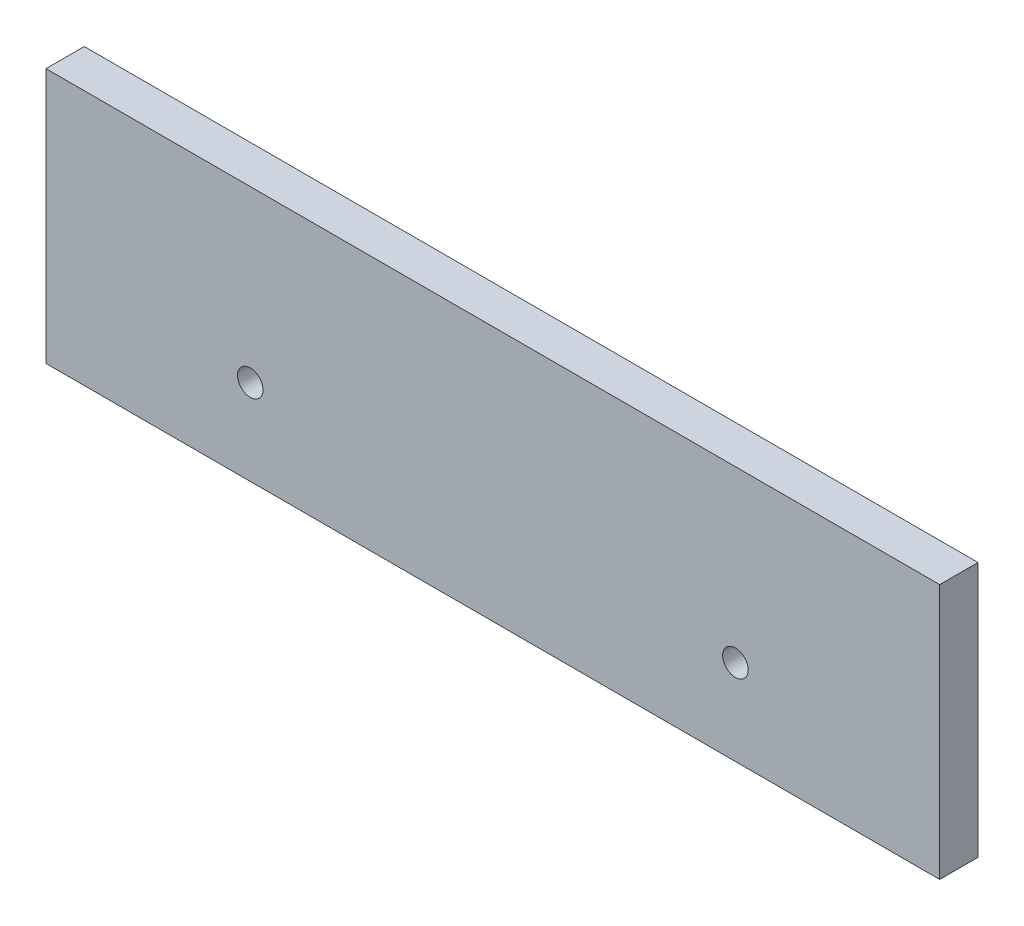
ISO-10303-21;
HEADER;
FILE_DESCRIPTION(('STEP AP214'),'2;1');
FILE_NAME('part.step','',(''),(''),'','','');
FILE_SCHEMA(('AUTOMOTIVE_DESIGN { 1 0 10303 214 1 1 1 1 }'));
ENDSEC;
DATA;
#1=APPLICATION_CONTEXT('core data for automotive mechanical design processes');
#2=APPLICATION_PROTOCOL_DEFINITION('international standard','automotive_design',2000,#1);
#3=PRODUCT_CONTEXT('',#1,'mechanical');
#4=PRODUCT('Part','Part','',(#3));
#5=PRODUCT_RELATED_PRODUCT_CATEGORY('part','',(#4));
#6=PRODUCT_DEFINITION_FORMATION('','',#4);
#7=PRODUCT_DEFINITION_CONTEXT('part definition',#1,'design');
#8=PRODUCT_DEFINITION('design','',#6,#7);
#9=PRODUCT_DEFINITION_SHAPE('','',#8);
#10=(LENGTH_UNIT() NAMED_UNIT(*) SI_UNIT(.MILLI.,.METRE.));
#11=(NAMED_UNIT(*) PLANE_ANGLE_UNIT() SI_UNIT($,.RADIAN.));
#12=(NAMED_UNIT(*) SI_UNIT($,.STERADIAN.) SOLID_ANGLE_UNIT());
#13=UNCERTAINTY_MEASURE_WITH_UNIT(LENGTH_MEASURE(1.E-05),#10,'distance_accuracy_value','');
#14=(GEOMETRIC_REPRESENTATION_CONTEXT(3) GLOBAL_UNCERTAINTY_ASSIGNED_CONTEXT((#13)) GLOBAL_UNIT_ASSIGNED_CONTEXT((#10,
#11,#12)) REPRESENTATION_CONTEXT('',''));
#15=CARTESIAN_POINT('',(0.,0.,0.));
#16=DIRECTION('',(0.,0.,1.));
#17=DIRECTION('',(1.,0.,0.));
#18=AXIS2_PLACEMENT_3D('',#15,#16,#17);
#19=CARTESIAN_POINT('',(-121.149822385747,12.2405260959693,39.3118505720358));
#20=DIRECTION('',(1.,0.,0.));
#21=DIRECTION('',(0.,0.,-1.));
#22=AXIS2_PLACEMENT_3D('',#19,#20,#21);
#23=PLANE('',#22);
#24=DIRECTION('',(0.,-1.,0.));
#25=VECTOR('',#24,1.);
#26=CARTESIAN_POINT('',(-121.149822385747,12.2405260959693,24.3118505720358));
#27=LINE('',#26,#25);
#28=CARTESIAN_POINT('',(-121.149822385747,112.240526095969,24.3118505720358));
#29=VERTEX_POINT('',#28);
#30=CARTESIAN_POINT('',(-121.149822385747,12.2405260959693,24.3118505720358));
#31=VERTEX_POINT('',#30);
#32=EDGE_CURVE('E97',#29,#31,#27,.T.);
#33=ORIENTED_EDGE('',*,*,#32,.F.);
#34=DIRECTION('',(0.,0.,-1.));
#35=VECTOR('',#34,1.);
#36=CARTESIAN_POINT('',(-121.149822385747,112.240526095969,39.3118505720358));
#37=LINE('',#36,#35);
#38=CARTESIAN_POINT('',(-121.149822385747,112.240526095969,39.3118505720358));
#39=VERTEX_POINT('',#38);
#40=EDGE_CURVE('E11',#39,#29,#37,.T.);
#41=ORIENTED_EDGE('',*,*,#40,.F.);
#42=DIRECTION('',(0.,-1.,0.));
#43=VECTOR('',#42,1.);
#44=CARTESIAN_POINT('',(-121.149822385747,12.2405260959693,39.3118505720358));
#45=LINE('',#44,#43);
#46=CARTESIAN_POINT('',(-121.149822385747,12.2405260959693,39.3118505720358));
#47=VERTEX_POINT('',#46);
#48=EDGE_CURVE('E90',#39,#47,#45,.T.);
#49=ORIENTED_EDGE('',*,*,#48,.T.);
#50=DIRECTION('',(0.,0.,-1.));
#51=VECTOR('',#50,1.);
#52=CARTESIAN_POINT('',(-121.149822385747,12.2405260959693,39.3118505720358));
#53=LINE('',#52,#51);
#54=EDGE_CURVE('E35',#47,#31,#53,.T.);
#55=ORIENTED_EDGE('',*,*,#54,.T.);
#56=EDGE_LOOP('',(#33,#41,#49,#55));
#57=FACE_BOUND('',#56,.T.);
#58=ADVANCED_FACE('F32',(#57),#23,.T.);
#59=CARTESIAN_POINT('',(-121.149822385747,112.240526095969,39.3118505720358));
#60=DIRECTION('',(0.,1.,0.));
#61=DIRECTION('',(0.,0.,1.));
#62=AXIS2_PLACEMENT_3D('',#59,#60,#61);
#63=PLANE('',#62);
#64=DIRECTION('',(1.,0.,0.));
#65=VECTOR('',#64,1.);
#66=CARTESIAN_POINT('',(-121.149822385747,112.240526095969,24.3118505720358));
#67=LINE('',#66,#65);
#68=CARTESIAN_POINT('',(-471.149822385747,112.240526095969,24.3118505720358));
#69=VERTEX_POINT('',#68);
#70=EDGE_CURVE('E92',#69,#29,#67,.T.);
#71=ORIENTED_EDGE('',*,*,#70,.F.);
#72=DIRECTION('',(0.,0.,-1.));
#73=VECTOR('',#72,1.);
#74=CARTESIAN_POINT('',(-471.149822385747,112.240526095969,39.3118505720358));
#75=LINE('',#74,#73);
#76=CARTESIAN_POINT('',(-471.149822385747,112.240526095969,39.3118505720358));
#77=VERTEX_POINT('',#76);
#78=EDGE_CURVE('E41',#77,#69,#75,.T.);
#79=ORIENTED_EDGE('',*,*,#78,.F.);
#80=DIRECTION('',(1.,0.,0.));
#81=VECTOR('',#80,1.);
#82=CARTESIAN_POINT('',(-121.149822385747,112.240526095969,39.3118505720358));
#83=LINE('',#82,#81);
#84=EDGE_CURVE('E87',#77,#39,#83,.T.);
#85=ORIENTED_EDGE('',*,*,#84,.T.);
#86=ORIENTED_EDGE('',*,*,#40,.T.);
#87=EDGE_LOOP('',(#71,#79,#85,#86));
#88=FACE_BOUND('',#87,.T.);
#89=ADVANCED_FACE('F108',(#88),#63,.T.);
#90=CARTESIAN_POINT('',(-471.149822385747,12.2405260959693,39.3118505720358));
#91=DIRECTION('',(-1.,0.,0.));
#92=DIRECTION('',(0.,-1.,0.));
#93=AXIS2_PLACEMENT_3D('',#90,#91,#92);
#94=PLANE('',#93);
#95=DIRECTION('',(0.,1.,0.));
#96=VECTOR('',#95,1.);
#97=CARTESIAN_POINT('',(-471.149822385747,12.2405260959693,24.3118505720358));
#98=LINE('',#97,#96);
#99=CARTESIAN_POINT('',(-471.149822385747,12.2405260959693,24.3118505720358));
#100=VERTEX_POINT('',#99);
#101=EDGE_CURVE('E82',#100,#69,#98,.T.);
#102=ORIENTED_EDGE('',*,*,#101,.F.);
#103=DIRECTION('',(0.,0.,-1.));
#104=VECTOR('',#103,1.);
#105=CARTESIAN_POINT('',(-471.149822385747,12.2405260959693,39.3118505720358));
#106=LINE('',#105,#104);
#107=CARTESIAN_POINT('',(-471.149822385747,12.2405260959693,39.3118505720358));
#108=VERTEX_POINT('',#107);
#109=EDGE_CURVE('E77',#108,#100,#106,.T.);
#110=ORIENTED_EDGE('',*,*,#109,.F.);
#111=DIRECTION('',(0.,1.,0.));
#112=VECTOR('',#111,1.);
#113=CARTESIAN_POINT('',(-471.149822385747,12.2405260959693,39.3118505720358));
#114=LINE('',#113,#112);
#115=EDGE_CURVE('E80',#108,#77,#114,.T.);
#116=ORIENTED_EDGE('',*,*,#115,.T.);
#117=ORIENTED_EDGE('',*,*,#78,.T.);
#118=EDGE_LOOP('',(#102,#110,#116,#117));
#119=FACE_BOUND('',#118,.T.);
#120=ADVANCED_FACE('F79',(#119),#94,.T.);
#121=CARTESIAN_POINT('',(-121.149822385747,12.2405260959693,39.3118505720358));
#122=DIRECTION('',(0.,-1.,0.));
#123=DIRECTION('',(1.,0.,0.));
#124=AXIS2_PLACEMENT_3D('',#121,#122,#123);
#125=PLANE('',#124);
#126=DIRECTION('',(-1.,0.,0.));
#127=VECTOR('',#126,1.);
#128=CARTESIAN_POINT('',(-121.149822385747,12.2405260959693,24.3118505720358));
#129=LINE('',#128,#127);
#130=EDGE_CURVE('E100',#31,#100,#129,.T.);
#131=ORIENTED_EDGE('',*,*,#130,.F.);
#132=ORIENTED_EDGE('',*,*,#54,.F.);
#133=DIRECTION('',(-1.,0.,0.));
#134=VECTOR('',#133,1.);
#135=CARTESIAN_POINT('',(-121.149822385747,12.2405260959693,39.3118505720358));
#136=LINE('',#135,#134);
#137=EDGE_CURVE('E86',#47,#108,#136,.T.);
#138=ORIENTED_EDGE('',*,*,#137,.T.);
#139=ORIENTED_EDGE('',*,*,#109,.T.);
#140=EDGE_LOOP('',(#131,#132,#138,#139));
#141=FACE_BOUND('',#140,.T.);
#142=ADVANCED_FACE('F89',(#141),#125,.T.);
#143=CARTESIAN_POINT('',(0.,0.,39.3118505720358));
#144=DIRECTION('',(0.,0.,1.));
#145=DIRECTION('',(1.,0.,0.));
#146=AXIS2_PLACEMENT_3D('',#143,#144,#145);
#147=PLANE('',#146);
#148=CARTESIAN_POINT('',(-391.149822385747,45.7405260959695,39.3118505720358));
#149=DIRECTION('',(0.,0.,-1.));
#150=DIRECTION('',(-1.,0.,0.));
#151=AXIS2_PLACEMENT_3D('',#148,#149,#150);
#152=CIRCLE('',#151,5.00000000000005);
#153=CARTESIAN_POINT('',(-396.149822385747,45.7405260959695,39.3118505720358));
#154=VERTEX_POINT('',#153);
#155=EDGE_CURVE('E141',#154,#154,#152,.T.);
#156=ORIENTED_EDGE('',*,*,#155,.T.);
#157=EDGE_LOOP('',(#156));
#158=FACE_BOUND('',#157,.T.);
#159=CARTESIAN_POINT('',(-201.149822385747,45.7405260959694,39.3118505720358));
#160=DIRECTION('',(0.,0.,-1.));
#161=DIRECTION('',(-1.,0.,0.));
#162=AXIS2_PLACEMENT_3D('',#159,#160,#161);
#163=CIRCLE('',#162,5.0000000000004);
#164=CARTESIAN_POINT('',(-206.149822385747,45.7405260959694,39.3118505720358));
#165=VERTEX_POINT('',#164);
#166=EDGE_CURVE('E101',#165,#165,#163,.T.);
#167=ORIENTED_EDGE('',*,*,#166,.T.);
#168=EDGE_LOOP('',(#167));
#169=FACE_BOUND('',#168,.T.);
#170=ORIENTED_EDGE('',*,*,#48,.F.);
#171=ORIENTED_EDGE('',*,*,#84,.F.);
#172=ORIENTED_EDGE('',*,*,#115,.F.);
#173=ORIENTED_EDGE('',*,*,#137,.F.);
#174=EDGE_LOOP('',(#170,#171,#172,#173));
#175=FACE_BOUND('',#174,.T.);
#176=ADVANCED_FACE('F85',(#158,#169,#175),#147,.T.);
#177=CARTESIAN_POINT('',(0.,0.,24.3118505720358));
#178=DIRECTION('',(0.,0.,1.));
#179=DIRECTION('',(1.,0.,0.));
#180=AXIS2_PLACEMENT_3D('',#177,#178,#179);
#181=PLANE('',#180);
#182=CARTESIAN_POINT('',(-391.149822385747,45.7405260959695,24.3118505720358));
#183=DIRECTION('',(0.,0.,-1.));
#184=DIRECTION('',(-1.,0.,0.));
#185=AXIS2_PLACEMENT_3D('',#182,#183,#184);
#186=CIRCLE('',#185,5.00000000000005);
#187=CARTESIAN_POINT('',(-396.149822385747,45.7405260959695,24.3118505720358));
#188=VERTEX_POINT('',#187);
#189=EDGE_CURVE('E144',#188,#188,#186,.T.);
#190=ORIENTED_EDGE('',*,*,#189,.F.);
#191=EDGE_LOOP('',(#190));
#192=FACE_BOUND('',#191,.T.);
#193=CARTESIAN_POINT('',(-201.149822385747,45.7405260959694,24.3118505720358));
#194=DIRECTION('',(0.,0.,-1.));
#195=DIRECTION('',(-1.,0.,0.));
#196=AXIS2_PLACEMENT_3D('',#193,#194,#195);
#197=CIRCLE('',#196,5.0000000000004);
#198=CARTESIAN_POINT('',(-206.149822385747,45.7405260959694,24.3118505720358));
#199=VERTEX_POINT('',#198);
#200=EDGE_CURVE('E146',#199,#199,#197,.T.);
#201=ORIENTED_EDGE('',*,*,#200,.F.);
#202=EDGE_LOOP('',(#201));
#203=FACE_BOUND('',#202,.T.);
#204=ORIENTED_EDGE('',*,*,#32,.T.);
#205=ORIENTED_EDGE('',*,*,#130,.T.);
#206=ORIENTED_EDGE('',*,*,#101,.T.);
#207=ORIENTED_EDGE('',*,*,#70,.T.);
#208=EDGE_LOOP('',(#204,#205,#206,#207));
#209=FACE_BOUND('',#208,.T.);
#210=ADVANCED_FACE('F107',(#192,#203,#209),#181,.F.);
#211=CARTESIAN_POINT('',(-201.149822385747,45.7405260959694,39.3118505720358));
#212=DIRECTION('',(0.,0.,-1.));
#213=DIRECTION('',(-1.,0.,0.));
#214=AXIS2_PLACEMENT_3D('',#211,#212,#213);
#215=CYLINDRICAL_SURFACE('',#214,5.0000000000004);
#216=ORIENTED_EDGE('',*,*,#166,.F.);
#217=EDGE_LOOP('',(#216));
#218=FACE_BOUND('',#217,.T.);
#219=ORIENTED_EDGE('',*,*,#200,.T.);
#220=EDGE_LOOP('',(#219));
#221=FACE_BOUND('',#220,.T.);
#222=ADVANCED_FACE('F126',(#218,#221),#215,.F.);
#223=CARTESIAN_POINT('',(-391.149822385747,45.7405260959695,39.3118505720358));
#224=DIRECTION('',(0.,0.,-1.));
#225=DIRECTION('',(-1.,0.,0.));
#226=AXIS2_PLACEMENT_3D('',#223,#224,#225);
#227=CYLINDRICAL_SURFACE('',#226,5.00000000000005);
#228=ORIENTED_EDGE('',*,*,#155,.F.);
#229=EDGE_LOOP('',(#228));
#230=FACE_BOUND('',#229,.T.);
#231=ORIENTED_EDGE('',*,*,#189,.T.);
#232=EDGE_LOOP('',(#231));
#233=FACE_BOUND('',#232,.T.);
#234=ADVANCED_FACE('F133',(#230,#233),#227,.F.);
#235=CLOSED_SHELL('',(#58,#89,#120,#142,#176,#210,#222,#234));
#236=MANIFOLD_SOLID_BREP('B2',#235);
#237=ADVANCED_BREP_SHAPE_REPRESENTATION('',(#18,#236),#14);
#238=SHAPE_DEFINITION_REPRESENTATION(#9,#237);
ENDSEC;
END-ISO-10303-21;
